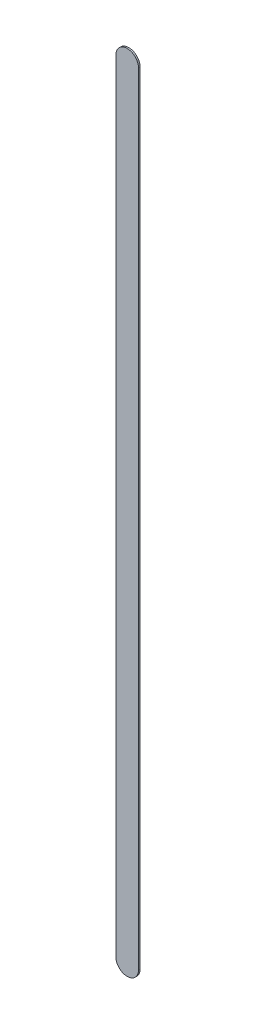
ISO-10303-21;
HEADER;
FILE_DESCRIPTION(('STEP AP214'),'2;1');
FILE_NAME('part.step','',(''),(''),'','','');
FILE_SCHEMA(('AUTOMOTIVE_DESIGN { 1 0 10303 214 1 1 1 1 }'));
ENDSEC;
DATA;
#1=APPLICATION_CONTEXT('core data for automotive mechanical design processes');
#2=APPLICATION_PROTOCOL_DEFINITION('international standard','automotive_design',2000,#1);
#3=PRODUCT_CONTEXT('',#1,'mechanical');
#4=PRODUCT('Part','Part','',(#3));
#5=PRODUCT_RELATED_PRODUCT_CATEGORY('part','',(#4));
#6=PRODUCT_DEFINITION_FORMATION('','',#4);
#7=PRODUCT_DEFINITION_CONTEXT('part definition',#1,'design');
#8=PRODUCT_DEFINITION('design','',#6,#7);
#9=PRODUCT_DEFINITION_SHAPE('','',#8);
#10=(LENGTH_UNIT() NAMED_UNIT(*) SI_UNIT(.MILLI.,.METRE.));
#11=(NAMED_UNIT(*) PLANE_ANGLE_UNIT() SI_UNIT($,.RADIAN.));
#12=(NAMED_UNIT(*) SI_UNIT($,.STERADIAN.) SOLID_ANGLE_UNIT());
#13=UNCERTAINTY_MEASURE_WITH_UNIT(LENGTH_MEASURE(1.E-05),#10,'distance_accuracy_value','');
#14=(GEOMETRIC_REPRESENTATION_CONTEXT(3) GLOBAL_UNCERTAINTY_ASSIGNED_CONTEXT((#13)) GLOBAL_UNIT_ASSIGNED_CONTEXT((#10,
#11,#12)) REPRESENTATION_CONTEXT('',''));
#15=CARTESIAN_POINT('',(0.,0.,0.));
#16=DIRECTION('',(0.,0.,1.));
#17=DIRECTION('',(1.,0.,0.));
#18=AXIS2_PLACEMENT_3D('',#15,#16,#17);
#19=CARTESIAN_POINT('',(119.13,-78.359,0.));
#20=DIRECTION('',(0.,0.,1.));
#21=DIRECTION('',(1.,0.,0.));
#22=AXIS2_PLACEMENT_3D('',#19,#20,#21);
#23=PLANE('',#22);
#24=DIRECTION('',(0.,-1.,0.));
#25=VECTOR('',#24,1.);
#26=CARTESIAN_POINT('',(119.13,-78.359,0.));
#27=LINE('',#26,#25);
#28=CARTESIAN_POINT('',(119.13,-78.359,0.));
#29=VERTEX_POINT('',#28);
#30=CARTESIAN_POINT('',(119.13,-95.631,0.));
#31=VERTEX_POINT('',#30);
#32=EDGE_CURVE('E82',#29,#31,#27,.T.);
#33=ORIENTED_EDGE('',*,*,#32,.T.);
#34=CARTESIAN_POINT('',(119.38,-95.631,0.));
#35=DIRECTION('',(0.,0.,1.));
#36=DIRECTION('',(-1.,0.,0.));
#37=AXIS2_PLACEMENT_3D('',#34,#35,#36);
#38=CIRCLE('',#37,0.25);
#39=CARTESIAN_POINT('',(119.63,-95.631,0.));
#40=VERTEX_POINT('',#39);
#41=EDGE_CURVE('E106',#31,#40,#38,.T.);
#42=ORIENTED_EDGE('',*,*,#41,.T.);
#43=DIRECTION('',(0.,1.,0.));
#44=VECTOR('',#43,1.);
#45=CARTESIAN_POINT('',(119.63,-95.631,0.));
#46=LINE('',#45,#44);
#47=CARTESIAN_POINT('',(119.63,-78.359,0.));
#48=VERTEX_POINT('',#47);
#49=EDGE_CURVE('E74',#40,#48,#46,.T.);
#50=ORIENTED_EDGE('',*,*,#49,.T.);
#51=CARTESIAN_POINT('',(119.38,-78.359,0.));
#52=DIRECTION('',(0.,0.,1.));
#53=DIRECTION('',(1.,0.,0.));
#54=AXIS2_PLACEMENT_3D('',#51,#52,#53);
#55=CIRCLE('',#54,0.25);
#56=EDGE_CURVE('E11',#48,#29,#55,.T.);
#57=ORIENTED_EDGE('',*,*,#56,.T.);
#58=EDGE_LOOP('',(#33,#42,#50,#57));
#59=FACE_BOUND('',#58,.T.);
#60=ADVANCED_FACE('F17',(#59),#23,.T.);
#61=CARTESIAN_POINT('',(119.13,-78.359,-0.035));
#62=DIRECTION('',(0.,0.,1.));
#63=DIRECTION('',(1.,0.,0.));
#64=AXIS2_PLACEMENT_3D('',#61,#62,#63);
#65=PLANE('',#64);
#66=CARTESIAN_POINT('',(119.38,-78.359,-0.035));
#67=DIRECTION('',(0.,0.,1.));
#68=DIRECTION('',(1.,0.,0.));
#69=AXIS2_PLACEMENT_3D('',#66,#67,#68);
#70=CIRCLE('',#69,0.25);
#71=CARTESIAN_POINT('',(119.63,-78.359,-0.035));
#72=VERTEX_POINT('',#71);
#73=CARTESIAN_POINT('',(119.13,-78.359,-0.035));
#74=VERTEX_POINT('',#73);
#75=EDGE_CURVE('E26',#72,#74,#70,.T.);
#76=ORIENTED_EDGE('',*,*,#75,.F.);
#77=DIRECTION('',(0.,1.,0.));
#78=VECTOR('',#77,1.);
#79=CARTESIAN_POINT('',(119.63,-95.631,-0.035));
#80=LINE('',#79,#78);
#81=CARTESIAN_POINT('',(119.63,-95.631,-0.035));
#82=VERTEX_POINT('',#81);
#83=EDGE_CURVE('E110',#82,#72,#80,.T.);
#84=ORIENTED_EDGE('',*,*,#83,.F.);
#85=CARTESIAN_POINT('',(119.38,-95.631,-0.035));
#86=DIRECTION('',(0.,0.,1.));
#87=DIRECTION('',(-1.,0.,0.));
#88=AXIS2_PLACEMENT_3D('',#85,#86,#87);
#89=CIRCLE('',#88,0.25);
#90=CARTESIAN_POINT('',(119.13,-95.631,-0.035));
#91=VERTEX_POINT('',#90);
#92=EDGE_CURVE('E84',#91,#82,#89,.T.);
#93=ORIENTED_EDGE('',*,*,#92,.F.);
#94=DIRECTION('',(0.,-1.,0.));
#95=VECTOR('',#94,1.);
#96=CARTESIAN_POINT('',(119.13,-78.359,-0.035));
#97=LINE('',#96,#95);
#98=EDGE_CURVE('E80',#74,#91,#97,.T.);
#99=ORIENTED_EDGE('',*,*,#98,.F.);
#100=EDGE_LOOP('',(#76,#84,#93,#99));
#101=FACE_BOUND('',#100,.T.);
#102=ADVANCED_FACE('F86',(#101),#65,.F.);
#103=CARTESIAN_POINT('',(119.38,-78.359,-0.035));
#104=DIRECTION('',(0.,0.,-1.));
#105=DIRECTION('',(1.,0.,0.));
#106=AXIS2_PLACEMENT_3D('',#103,#104,#105);
#107=CYLINDRICAL_SURFACE('',#106,0.25);
#108=ORIENTED_EDGE('',*,*,#75,.T.);
#109=DIRECTION('',(0.,0.,1.));
#110=VECTOR('',#109,1.);
#111=CARTESIAN_POINT('',(119.13,-78.359,-0.035));
#112=LINE('',#111,#110);
#113=EDGE_CURVE('E69',#74,#29,#112,.T.);
#114=ORIENTED_EDGE('',*,*,#113,.T.);
#115=ORIENTED_EDGE('',*,*,#56,.F.);
#116=DIRECTION('',(0.,0.,1.));
#117=VECTOR('',#116,1.);
#118=CARTESIAN_POINT('',(119.63,-78.359,-0.035));
#119=LINE('',#118,#117);
#120=EDGE_CURVE('E20',#72,#48,#119,.T.);
#121=ORIENTED_EDGE('',*,*,#120,.F.);
#122=EDGE_LOOP('',(#108,#114,#115,#121));
#123=FACE_BOUND('',#122,.T.);
#124=ADVANCED_FACE('F68',(#123),#107,.T.);
#125=CARTESIAN_POINT('',(119.63,-95.631,-0.035));
#126=DIRECTION('',(-1.,0.,0.));
#127=DIRECTION('',(0.,0.,1.));
#128=AXIS2_PLACEMENT_3D('',#125,#126,#127);
#129=PLANE('',#128);
#130=ORIENTED_EDGE('',*,*,#83,.T.);
#131=ORIENTED_EDGE('',*,*,#120,.T.);
#132=ORIENTED_EDGE('',*,*,#49,.F.);
#133=DIRECTION('',(0.,0.,1.));
#134=VECTOR('',#133,1.);
#135=CARTESIAN_POINT('',(119.63,-95.631,-0.035));
#136=LINE('',#135,#134);
#137=EDGE_CURVE('E102',#82,#40,#136,.T.);
#138=ORIENTED_EDGE('',*,*,#137,.F.);
#139=EDGE_LOOP('',(#130,#131,#132,#138));
#140=FACE_BOUND('',#139,.T.);
#141=ADVANCED_FACE('F121',(#140),#129,.F.);
#142=CARTESIAN_POINT('',(119.38,-95.631,-0.035));
#143=DIRECTION('',(0.,0.,-1.));
#144=DIRECTION('',(-1.,0.,0.));
#145=AXIS2_PLACEMENT_3D('',#142,#143,#144);
#146=CYLINDRICAL_SURFACE('',#145,0.25);
#147=ORIENTED_EDGE('',*,*,#92,.T.);
#148=ORIENTED_EDGE('',*,*,#137,.T.);
#149=ORIENTED_EDGE('',*,*,#41,.F.);
#150=DIRECTION('',(0.,0.,1.));
#151=VECTOR('',#150,1.);
#152=CARTESIAN_POINT('',(119.13,-95.631,-0.035));
#153=LINE('',#152,#151);
#154=EDGE_CURVE('E90',#91,#31,#153,.T.);
#155=ORIENTED_EDGE('',*,*,#154,.F.);
#156=EDGE_LOOP('',(#147,#148,#149,#155));
#157=FACE_BOUND('',#156,.T.);
#158=ADVANCED_FACE('F124',(#157),#146,.T.);
#159=CARTESIAN_POINT('',(119.13,-78.359,-0.035));
#160=DIRECTION('',(1.,0.,0.));
#161=DIRECTION('',(0.,1.,0.));
#162=AXIS2_PLACEMENT_3D('',#159,#160,#161);
#163=PLANE('',#162);
#164=ORIENTED_EDGE('',*,*,#98,.T.);
#165=ORIENTED_EDGE('',*,*,#154,.T.);
#166=ORIENTED_EDGE('',*,*,#32,.F.);
#167=ORIENTED_EDGE('',*,*,#113,.F.);
#168=EDGE_LOOP('',(#164,#165,#166,#167));
#169=FACE_BOUND('',#168,.T.);
#170=ADVANCED_FACE('F78',(#169),#163,.F.);
#171=CLOSED_SHELL('',(#60,#102,#124,#141,#158,#170));
#172=MANIFOLD_SOLID_BREP('B1',#171);
#173=ADVANCED_BREP_SHAPE_REPRESENTATION('',(#18,#172),#14);
#174=SHAPE_DEFINITION_REPRESENTATION(#9,#173);
ENDSEC;
END-ISO-10303-21;
